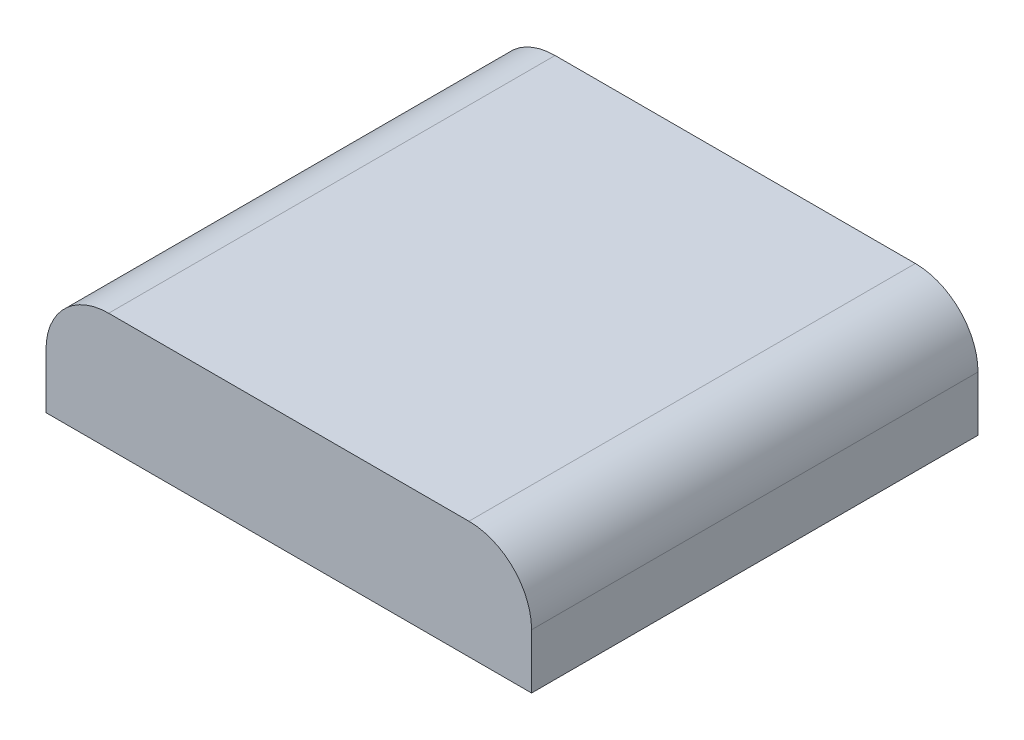
ISO-10303-21;
HEADER;
FILE_DESCRIPTION(('STEP AP214'),'2;1');
FILE_NAME('part.step','',(''),(''),'','','');
FILE_SCHEMA(('AUTOMOTIVE_DESIGN { 1 0 10303 214 1 1 1 1 }'));
ENDSEC;
DATA;
#1=APPLICATION_CONTEXT('core data for automotive mechanical design processes');
#2=APPLICATION_PROTOCOL_DEFINITION('international standard','automotive_design',2000,#1);
#3=PRODUCT_CONTEXT('',#1,'mechanical');
#4=PRODUCT('Part','Part','',(#3));
#5=PRODUCT_RELATED_PRODUCT_CATEGORY('part','',(#4));
#6=PRODUCT_DEFINITION_FORMATION('','',#4);
#7=PRODUCT_DEFINITION_CONTEXT('part definition',#1,'design');
#8=PRODUCT_DEFINITION('design','',#6,#7);
#9=PRODUCT_DEFINITION_SHAPE('','',#8);
#10=(LENGTH_UNIT() NAMED_UNIT(*) SI_UNIT(.MILLI.,.METRE.));
#11=(NAMED_UNIT(*) PLANE_ANGLE_UNIT() SI_UNIT($,.RADIAN.));
#12=(NAMED_UNIT(*) SI_UNIT($,.STERADIAN.) SOLID_ANGLE_UNIT());
#13=UNCERTAINTY_MEASURE_WITH_UNIT(LENGTH_MEASURE(1.E-05),#10,'distance_accuracy_value','');
#14=(GEOMETRIC_REPRESENTATION_CONTEXT(3) GLOBAL_UNCERTAINTY_ASSIGNED_CONTEXT((#13)) GLOBAL_UNIT_ASSIGNED_CONTEXT((#10,
#11,#12)) REPRESENTATION_CONTEXT('',''));
#15=CARTESIAN_POINT('',(0.,0.,0.));
#16=DIRECTION('',(0.,0.,1.));
#17=DIRECTION('',(1.,0.,0.));
#18=AXIS2_PLACEMENT_3D('',#15,#16,#17);
#19=CARTESIAN_POINT('',(0.,15.,0.));
#20=DIRECTION('',(1.,0.,0.));
#21=DIRECTION('',(0.,0.,-1.));
#22=AXIS2_PLACEMENT_3D('',#19,#20,#21);
#23=PLANE('',#22);
#24=DIRECTION('',(0.,-1.,0.));
#25=VECTOR('',#24,1.);
#26=CARTESIAN_POINT('',(0.,15.,0.));
#27=LINE('',#26,#25);
#28=CARTESIAN_POINT('',(0.,7.,0.));
#29=VERTEX_POINT('',#28);
#30=CARTESIAN_POINT('',(0.,0.,0.));
#31=VERTEX_POINT('',#30);
#32=EDGE_CURVE('E84',#29,#31,#27,.T.);
#33=ORIENTED_EDGE('',*,*,#32,.F.);
#34=DIRECTION('',(0.,0.,1.));
#35=VECTOR('',#34,1.);
#36=CARTESIAN_POINT('',(0.,7.,0.));
#37=LINE('',#36,#35);
#38=CARTESIAN_POINT('',(0.,7.,-57.));
#39=VERTEX_POINT('',#38);
#40=EDGE_CURVE('E11',#29,#39,#37,.F.);
#41=ORIENTED_EDGE('',*,*,#40,.T.);
#42=DIRECTION('',(0.,-1.,0.));
#43=VECTOR('',#42,1.);
#44=CARTESIAN_POINT('',(0.,15.,-57.));
#45=LINE('',#44,#43);
#46=CARTESIAN_POINT('',(0.,0.,-57.));
#47=VERTEX_POINT('',#46);
#48=EDGE_CURVE('E104',#39,#47,#45,.T.);
#49=ORIENTED_EDGE('',*,*,#48,.T.);
#50=DIRECTION('',(0.,0.,1.));
#51=VECTOR('',#50,1.);
#52=CARTESIAN_POINT('',(0.,0.,0.));
#53=LINE('',#52,#51);
#54=EDGE_CURVE('E99',#47,#31,#53,.T.);
#55=ORIENTED_EDGE('',*,*,#54,.T.);
#56=EDGE_LOOP('',(#33,#41,#49,#55));
#57=FACE_BOUND('',#56,.T.);
#58=ADVANCED_FACE('F33',(#57),#23,.F.);
#59=CARTESIAN_POINT('',(0.,15.,0.));
#60=DIRECTION('',(0.,0.,-1.));
#61=DIRECTION('',(-1.,0.,0.));
#62=AXIS2_PLACEMENT_3D('',#59,#60,#61);
#63=PLANE('',#62);
#64=DIRECTION('',(0.,-1.,0.));
#65=VECTOR('',#64,1.);
#66=CARTESIAN_POINT('',(62.,15.,0.));
#67=LINE('',#66,#65);
#68=CARTESIAN_POINT('',(62.,7.,0.));
#69=VERTEX_POINT('',#68);
#70=CARTESIAN_POINT('',(62.,0.,0.));
#71=VERTEX_POINT('',#70);
#72=EDGE_CURVE('E93',#69,#71,#67,.T.);
#73=ORIENTED_EDGE('',*,*,#72,.F.);
#74=CARTESIAN_POINT('',(54.,7.,0.));
#75=DIRECTION('',(0.,0.,-1.));
#76=DIRECTION('',(-1.,0.,0.));
#77=AXIS2_PLACEMENT_3D('',#74,#75,#76);
#78=CIRCLE('',#77,8.);
#79=CARTESIAN_POINT('',(54.,15.,0.));
#80=VERTEX_POINT('',#79);
#81=EDGE_CURVE('E41',#69,#80,#78,.F.);
#82=ORIENTED_EDGE('',*,*,#81,.T.);
#83=DIRECTION('',(1.,0.,0.));
#84=VECTOR('',#83,1.);
#85=CARTESIAN_POINT('',(0.,15.,0.));
#86=LINE('',#85,#84);
#87=CARTESIAN_POINT('',(8.,15.,0.));
#88=VERTEX_POINT('',#87);
#89=EDGE_CURVE('E114',#88,#80,#86,.T.);
#90=ORIENTED_EDGE('',*,*,#89,.F.);
#91=CARTESIAN_POINT('',(8.,7.,0.));
#92=DIRECTION('',(0.,0.,-1.));
#93=DIRECTION('',(-1.,0.,0.));
#94=AXIS2_PLACEMENT_3D('',#91,#92,#93);
#95=CIRCLE('',#94,8.);
#96=EDGE_CURVE('E48',#88,#29,#95,.F.);
#97=ORIENTED_EDGE('',*,*,#96,.T.);
#98=ORIENTED_EDGE('',*,*,#32,.T.);
#99=DIRECTION('',(1.,0.,0.));
#100=VECTOR('',#99,1.);
#101=CARTESIAN_POINT('',(0.,0.,0.));
#102=LINE('',#101,#100);
#103=EDGE_CURVE('E87',#31,#71,#102,.T.);
#104=ORIENTED_EDGE('',*,*,#103,.T.);
#105=EDGE_LOOP('',(#73,#82,#90,#97,#98,#104));
#106=FACE_BOUND('',#105,.T.);
#107=ADVANCED_FACE('F86',(#106),#63,.F.);
#108=CARTESIAN_POINT('',(62.,15.,0.));
#109=DIRECTION('',(-1.,0.,0.));
#110=DIRECTION('',(0.,0.,1.));
#111=AXIS2_PLACEMENT_3D('',#108,#109,#110);
#112=PLANE('',#111);
#113=DIRECTION('',(0.,-1.,0.));
#114=VECTOR('',#113,1.);
#115=CARTESIAN_POINT('',(62.,15.,-57.));
#116=LINE('',#115,#114);
#117=CARTESIAN_POINT('',(62.,7.,-57.));
#118=VERTEX_POINT('',#117);
#119=CARTESIAN_POINT('',(62.,0.,-57.));
#120=VERTEX_POINT('',#119);
#121=EDGE_CURVE('E116',#118,#120,#116,.T.);
#122=ORIENTED_EDGE('',*,*,#121,.F.);
#123=DIRECTION('',(0.,0.,-1.));
#124=VECTOR('',#123,1.);
#125=CARTESIAN_POINT('',(62.,7.,0.));
#126=LINE('',#125,#124);
#127=EDGE_CURVE('E56',#118,#69,#126,.F.);
#128=ORIENTED_EDGE('',*,*,#127,.T.);
#129=ORIENTED_EDGE('',*,*,#72,.T.);
#130=DIRECTION('',(0.,0.,-1.));
#131=VECTOR('',#130,1.);
#132=CARTESIAN_POINT('',(62.,0.,0.));
#133=LINE('',#132,#131);
#134=EDGE_CURVE('E101',#71,#120,#133,.T.);
#135=ORIENTED_EDGE('',*,*,#134,.T.);
#136=EDGE_LOOP('',(#122,#128,#129,#135));
#137=FACE_BOUND('',#136,.T.);
#138=ADVANCED_FACE('F141',(#137),#112,.F.);
#139=CARTESIAN_POINT('',(0.,15.,-57.));
#140=DIRECTION('',(0.,0.,1.));
#141=DIRECTION('',(1.,0.,0.));
#142=AXIS2_PLACEMENT_3D('',#139,#140,#141);
#143=PLANE('',#142);
#144=DIRECTION('',(-1.,0.,0.));
#145=VECTOR('',#144,1.);
#146=CARTESIAN_POINT('',(0.,15.,-57.));
#147=LINE('',#146,#145);
#148=CARTESIAN_POINT('',(54.,15.,-57.));
#149=VERTEX_POINT('',#148);
#150=CARTESIAN_POINT('',(8.,15.,-57.));
#151=VERTEX_POINT('',#150);
#152=EDGE_CURVE('E108',#149,#151,#147,.T.);
#153=ORIENTED_EDGE('',*,*,#152,.F.);
#154=CARTESIAN_POINT('',(54.,7.,-57.));
#155=DIRECTION('',(0.,0.,1.));
#156=DIRECTION('',(1.,0.,0.));
#157=AXIS2_PLACEMENT_3D('',#154,#155,#156);
#158=CIRCLE('',#157,8.);
#159=EDGE_CURVE('E126',#149,#118,#158,.F.);
#160=ORIENTED_EDGE('',*,*,#159,.T.);
#161=ORIENTED_EDGE('',*,*,#121,.T.);
#162=DIRECTION('',(-1.,0.,0.));
#163=VECTOR('',#162,1.);
#164=CARTESIAN_POINT('',(0.,0.,-57.));
#165=LINE('',#164,#163);
#166=EDGE_CURVE('E112',#120,#47,#165,.T.);
#167=ORIENTED_EDGE('',*,*,#166,.T.);
#168=ORIENTED_EDGE('',*,*,#48,.F.);
#169=CARTESIAN_POINT('',(8.,7.,-57.));
#170=DIRECTION('',(0.,0.,1.));
#171=DIRECTION('',(1.,0.,0.));
#172=AXIS2_PLACEMENT_3D('',#169,#170,#171);
#173=CIRCLE('',#172,8.);
#174=EDGE_CURVE('E124',#39,#151,#173,.F.);
#175=ORIENTED_EDGE('',*,*,#174,.T.);
#176=EDGE_LOOP('',(#153,#160,#161,#167,#168,#175));
#177=FACE_BOUND('',#176,.T.);
#178=ADVANCED_FACE('F140',(#177),#143,.F.);
#179=CARTESIAN_POINT('',(0.,15.,0.));
#180=DIRECTION('',(0.,-1.,0.));
#181=DIRECTION('',(0.,0.,-1.));
#182=AXIS2_PLACEMENT_3D('',#179,#180,#181);
#183=PLANE('',#182);
#184=ORIENTED_EDGE('',*,*,#89,.T.);
#185=DIRECTION('',(0.,0.,-1.));
#186=VECTOR('',#185,1.);
#187=CARTESIAN_POINT('',(54.,15.,0.));
#188=LINE('',#187,#186);
#189=EDGE_CURVE('E121',#80,#149,#188,.T.);
#190=ORIENTED_EDGE('',*,*,#189,.T.);
#191=ORIENTED_EDGE('',*,*,#152,.T.);
#192=DIRECTION('',(0.,0.,1.));
#193=VECTOR('',#192,1.);
#194=CARTESIAN_POINT('',(8.,15.,0.));
#195=LINE('',#194,#193);
#196=EDGE_CURVE('E92',#151,#88,#195,.T.);
#197=ORIENTED_EDGE('',*,*,#196,.T.);
#198=EDGE_LOOP('',(#184,#190,#191,#197));
#199=FACE_BOUND('',#198,.T.);
#200=ADVANCED_FACE('F134',(#199),#183,.F.);
#201=CARTESIAN_POINT('',(0.,0.,0.));
#202=DIRECTION('',(0.,-1.,0.));
#203=DIRECTION('',(0.,0.,-1.));
#204=AXIS2_PLACEMENT_3D('',#201,#202,#203);
#205=PLANE('',#204);
#206=ORIENTED_EDGE('',*,*,#54,.F.);
#207=ORIENTED_EDGE('',*,*,#166,.F.);
#208=ORIENTED_EDGE('',*,*,#134,.F.);
#209=ORIENTED_EDGE('',*,*,#103,.F.);
#210=EDGE_LOOP('',(#206,#207,#208,#209));
#211=FACE_BOUND('',#210,.T.);
#212=ADVANCED_FACE('F97',(#211),#205,.T.);
#213=CARTESIAN_POINT('',(54.,7.,0.));
#214=DIRECTION('',(0.,0.,-1.));
#215=DIRECTION('',(-1.,0.,0.));
#216=AXIS2_PLACEMENT_3D('',#213,#214,#215);
#217=CYLINDRICAL_SURFACE('',#216,8.);
#218=ORIENTED_EDGE('',*,*,#81,.F.);
#219=ORIENTED_EDGE('',*,*,#127,.F.);
#220=ORIENTED_EDGE('',*,*,#159,.F.);
#221=ORIENTED_EDGE('',*,*,#189,.F.);
#222=EDGE_LOOP('',(#218,#219,#220,#221));
#223=FACE_BOUND('',#222,.T.);
#224=ADVANCED_FACE('F138',(#223),#217,.T.);
#225=CARTESIAN_POINT('',(8.,7.,0.));
#226=DIRECTION('',(0.,0.,1.));
#227=DIRECTION('',(1.,0.,0.));
#228=AXIS2_PLACEMENT_3D('',#225,#226,#227);
#229=CYLINDRICAL_SURFACE('',#228,8.);
#230=ORIENTED_EDGE('',*,*,#174,.F.);
#231=ORIENTED_EDGE('',*,*,#40,.F.);
#232=ORIENTED_EDGE('',*,*,#96,.F.);
#233=ORIENTED_EDGE('',*,*,#196,.F.);
#234=EDGE_LOOP('',(#230,#231,#232,#233));
#235=FACE_BOUND('',#234,.T.);
#236=ADVANCED_FACE('F35',(#235),#229,.T.);
#237=CLOSED_SHELL('',(#58,#107,#138,#178,#200,#212,#224,#236));
#238=MANIFOLD_SOLID_BREP('B2',#237);
#239=ADVANCED_BREP_SHAPE_REPRESENTATION('',(#18,#238),#14);
#240=SHAPE_DEFINITION_REPRESENTATION(#9,#239);
ENDSEC;
END-ISO-10303-21;
